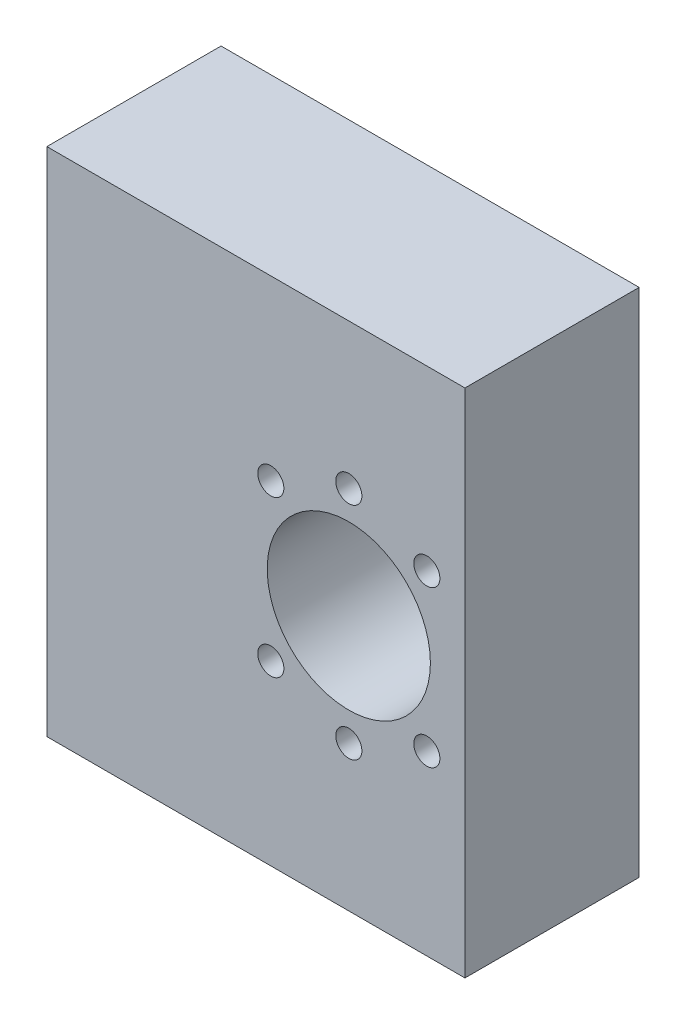
ISO-10303-21;
HEADER;
FILE_DESCRIPTION(('STEP AP214'),'2;1');
FILE_NAME('part.step','',(''),(''),'','','');
FILE_SCHEMA(('AUTOMOTIVE_DESIGN { 1 0 10303 214 1 1 1 1 }'));
ENDSEC;
DATA;
#1=APPLICATION_CONTEXT('core data for automotive mechanical design processes');
#2=APPLICATION_PROTOCOL_DEFINITION('international standard','automotive_design',2000,#1);
#3=PRODUCT_CONTEXT('',#1,'mechanical');
#4=PRODUCT('Part','Part','',(#3));
#5=PRODUCT_RELATED_PRODUCT_CATEGORY('part','',(#4));
#6=PRODUCT_DEFINITION_FORMATION('','',#4);
#7=PRODUCT_DEFINITION_CONTEXT('part definition',#1,'design');
#8=PRODUCT_DEFINITION('design','',#6,#7);
#9=PRODUCT_DEFINITION_SHAPE('','',#8);
#10=(LENGTH_UNIT() NAMED_UNIT(*) SI_UNIT(.MILLI.,.METRE.));
#11=(NAMED_UNIT(*) PLANE_ANGLE_UNIT() SI_UNIT($,.RADIAN.));
#12=(NAMED_UNIT(*) SI_UNIT($,.STERADIAN.) SOLID_ANGLE_UNIT());
#13=UNCERTAINTY_MEASURE_WITH_UNIT(LENGTH_MEASURE(1.E-05),#10,'distance_accuracy_value','');
#14=(GEOMETRIC_REPRESENTATION_CONTEXT(3) GLOBAL_UNCERTAINTY_ASSIGNED_CONTEXT((#13)) GLOBAL_UNIT_ASSIGNED_CONTEXT((#10,
#11,#12)) REPRESENTATION_CONTEXT('',''));
#15=CARTESIAN_POINT('',(0.,0.,0.));
#16=DIRECTION('',(0.,0.,1.));
#17=DIRECTION('',(1.,0.,0.));
#18=AXIS2_PLACEMENT_3D('',#15,#16,#17);
#19=CARTESIAN_POINT('',(-52.,-88.5803268221012,40.));
#20=DIRECTION('',(1.,0.,0.));
#21=DIRECTION('',(0.,0.,-1.));
#22=AXIS2_PLACEMENT_3D('',#19,#20,#21);
#23=PLANE('',#22);
#24=CARTESIAN_POINT('',(-52.,39.,32.5));
#25=DIRECTION('',(-1.,0.,0.));
#26=DIRECTION('',(0.,0.,1.));
#27=AXIS2_PLACEMENT_3D('',#24,#25,#26);
#28=CIRCLE('',#27,2.25);
#29=CARTESIAN_POINT('',(-52.,39.,34.75));
#30=VERTEX_POINT('',#29);
#31=EDGE_CURVE('E294',#30,#30,#28,.T.);
#32=ORIENTED_EDGE('',*,*,#31,.F.);
#33=EDGE_LOOP('',(#32));
#34=FACE_BOUND('',#33,.T.);
#35=CARTESIAN_POINT('',(-52.,19.,32.5));
#36=DIRECTION('',(-1.,0.,0.));
#37=DIRECTION('',(0.,0.,1.));
#38=AXIS2_PLACEMENT_3D('',#35,#36,#37);
#39=CIRCLE('',#38,2.25);
#40=CARTESIAN_POINT('',(-52.,19.,34.75));
#41=VERTEX_POINT('',#40);
#42=EDGE_CURVE('E293',#41,#41,#39,.T.);
#43=ORIENTED_EDGE('',*,*,#42,.F.);
#44=EDGE_LOOP('',(#43));
#45=FACE_BOUND('',#44,.T.);
#46=CARTESIAN_POINT('',(-52.,0.,32.5));
#47=DIRECTION('',(-1.,0.,0.));
#48=DIRECTION('',(0.,0.,1.));
#49=AXIS2_PLACEMENT_3D('',#46,#47,#48);
#50=CIRCLE('',#49,2.25);
#51=CARTESIAN_POINT('',(-52.,0.,34.75));
#52=VERTEX_POINT('',#51);
#53=EDGE_CURVE('E304',#52,#52,#50,.T.);
#54=ORIENTED_EDGE('',*,*,#53,.F.);
#55=EDGE_LOOP('',(#54));
#56=FACE_BOUND('',#55,.T.);
#57=CARTESIAN_POINT('',(-52.,-19.,32.5));
#58=DIRECTION('',(-1.,0.,0.));
#59=DIRECTION('',(0.,0.,1.));
#60=AXIS2_PLACEMENT_3D('',#57,#58,#59);
#61=CIRCLE('',#60,2.25);
#62=CARTESIAN_POINT('',(-52.,-19.,34.75));
#63=VERTEX_POINT('',#62);
#64=EDGE_CURVE('E310',#63,#63,#61,.T.);
#65=ORIENTED_EDGE('',*,*,#64,.F.);
#66=EDGE_LOOP('',(#65));
#67=FACE_BOUND('',#66,.T.);
#68=CARTESIAN_POINT('',(-52.,-39.,32.5));
#69=DIRECTION('',(-1.,0.,0.));
#70=DIRECTION('',(0.,0.,1.));
#71=AXIS2_PLACEMENT_3D('',#68,#69,#70);
#72=CIRCLE('',#71,2.25);
#73=CARTESIAN_POINT('',(-52.,-39.,34.75));
#74=VERTEX_POINT('',#73);
#75=EDGE_CURVE('E316',#74,#74,#72,.T.);
#76=ORIENTED_EDGE('',*,*,#75,.F.);
#77=EDGE_LOOP('',(#76));
#78=FACE_BOUND('',#77,.T.);
#79=CARTESIAN_POINT('',(-52.,0.,17.5));
#80=DIRECTION('',(-1.,0.,0.));
#81=DIRECTION('',(0.,0.,1.));
#82=AXIS2_PLACEMENT_3D('',#79,#80,#81);
#83=CIRCLE('',#82,2.25);
#84=CARTESIAN_POINT('',(-52.,0.,19.75));
#85=VERTEX_POINT('',#84);
#86=EDGE_CURVE('E322',#85,#85,#83,.T.);
#87=ORIENTED_EDGE('',*,*,#86,.F.);
#88=EDGE_LOOP('',(#87));
#89=FACE_BOUND('',#88,.T.);
#90=CARTESIAN_POINT('',(-52.,-19.,17.5));
#91=DIRECTION('',(-1.,0.,0.));
#92=DIRECTION('',(0.,0.,1.));
#93=AXIS2_PLACEMENT_3D('',#90,#91,#92);
#94=CIRCLE('',#93,2.25);
#95=CARTESIAN_POINT('',(-52.,-19.,19.75));
#96=VERTEX_POINT('',#95);
#97=EDGE_CURVE('E328',#96,#96,#94,.T.);
#98=ORIENTED_EDGE('',*,*,#97,.F.);
#99=EDGE_LOOP('',(#98));
#100=FACE_BOUND('',#99,.T.);
#101=CARTESIAN_POINT('',(-52.,-39.,17.5));
#102=DIRECTION('',(-1.,0.,0.));
#103=DIRECTION('',(0.,0.,1.));
#104=AXIS2_PLACEMENT_3D('',#101,#102,#103);
#105=CIRCLE('',#104,2.25);
#106=CARTESIAN_POINT('',(-52.,-39.,19.75));
#107=VERTEX_POINT('',#106);
#108=EDGE_CURVE('E334',#107,#107,#105,.T.);
#109=ORIENTED_EDGE('',*,*,#108,.F.);
#110=EDGE_LOOP('',(#109));
#111=FACE_BOUND('',#110,.T.);
#112=CARTESIAN_POINT('',(-52.,39.,17.5));
#113=DIRECTION('',(-1.,0.,0.));
#114=DIRECTION('',(0.,0.,1.));
#115=AXIS2_PLACEMENT_3D('',#112,#113,#114);
#116=CIRCLE('',#115,2.25);
#117=CARTESIAN_POINT('',(-52.,39.,19.75));
#118=VERTEX_POINT('',#117);
#119=EDGE_CURVE('E340',#118,#118,#116,.T.);
#120=ORIENTED_EDGE('',*,*,#119,.F.);
#121=EDGE_LOOP('',(#120));
#122=FACE_BOUND('',#121,.T.);
#123=CARTESIAN_POINT('',(-52.,19.,17.5));
#124=DIRECTION('',(-1.,0.,0.));
#125=DIRECTION('',(0.,0.,1.));
#126=AXIS2_PLACEMENT_3D('',#123,#124,#125);
#127=CIRCLE('',#126,2.25);
#128=CARTESIAN_POINT('',(-52.,19.,19.75));
#129=VERTEX_POINT('',#128);
#130=EDGE_CURVE('E346',#129,#129,#127,.T.);
#131=ORIENTED_EDGE('',*,*,#130,.F.);
#132=EDGE_LOOP('',(#131));
#133=FACE_BOUND('',#132,.T.);
#134=DIRECTION('',(0.,-1.,0.));
#135=VECTOR('',#134,1.);
#136=CARTESIAN_POINT('',(-52.,-88.5803268221012,10.));
#137=LINE('',#136,#135);
#138=CARTESIAN_POINT('',(-52.,44.,10.));
#139=VERTEX_POINT('',#138);
#140=CARTESIAN_POINT('',(-52.,-44.,10.));
#141=VERTEX_POINT('',#140);
#142=EDGE_CURVE('E77',#139,#141,#137,.T.);
#143=ORIENTED_EDGE('',*,*,#142,.T.);
#144=DIRECTION('',(0.,0.,-1.));
#145=VECTOR('',#144,1.);
#146=CARTESIAN_POINT('',(-52.,-44.,40.));
#147=LINE('',#146,#145);
#148=CARTESIAN_POINT('',(-52.,-44.,40.));
#149=VERTEX_POINT('',#148);
#150=EDGE_CURVE('E11',#149,#141,#147,.T.);
#151=ORIENTED_EDGE('',*,*,#150,.F.);
#152=DIRECTION('',(0.,-1.,0.));
#153=VECTOR('',#152,1.);
#154=CARTESIAN_POINT('',(-52.,-88.5803268221012,40.));
#155=LINE('',#154,#153);
#156=CARTESIAN_POINT('',(-52.,44.,40.));
#157=VERTEX_POINT('',#156);
#158=EDGE_CURVE('E118',#157,#149,#155,.T.);
#159=ORIENTED_EDGE('',*,*,#158,.F.);
#160=DIRECTION('',(0.,0.,-1.));
#161=VECTOR('',#160,1.);
#162=CARTESIAN_POINT('',(-52.,44.,40.));
#163=LINE('',#162,#161);
#164=EDGE_CURVE('E44',#157,#139,#163,.T.);
#165=ORIENTED_EDGE('',*,*,#164,.T.);
#166=EDGE_LOOP('',(#143,#151,#159,#165));
#167=FACE_BOUND('',#166,.T.);
#168=ADVANCED_FACE('F29',(#34,#45,#56,#67,#78,#89,#100,#111,#122,#133,#167),#23,.F.);
#169=CARTESIAN_POINT('',(-16.,-44.,40.));
#170=DIRECTION('',(0.,1.,0.));
#171=DIRECTION('',(0.,0.,1.));
#172=AXIS2_PLACEMENT_3D('',#169,#170,#171);
#173=PLANE('',#172);
#174=DIRECTION('',(1.,0.,0.));
#175=VECTOR('',#174,1.);
#176=CARTESIAN_POINT('',(-16.,-44.,10.));
#177=LINE('',#176,#175);
#178=CARTESIAN_POINT('',(20.,-44.,10.));
#179=VERTEX_POINT('',#178);
#180=EDGE_CURVE('E73',#141,#179,#177,.T.);
#181=ORIENTED_EDGE('',*,*,#180,.T.);
#182=DIRECTION('',(0.,0.,-1.));
#183=VECTOR('',#182,1.);
#184=CARTESIAN_POINT('',(20.,-44.,40.));
#185=LINE('',#184,#183);
#186=CARTESIAN_POINT('',(20.,-44.,40.));
#187=VERTEX_POINT('',#186);
#188=EDGE_CURVE('E37',#187,#179,#185,.T.);
#189=ORIENTED_EDGE('',*,*,#188,.F.);
#190=DIRECTION('',(1.,0.,0.));
#191=VECTOR('',#190,1.);
#192=CARTESIAN_POINT('',(-16.,-44.,40.));
#193=LINE('',#192,#191);
#194=EDGE_CURVE('E84',#149,#187,#193,.T.);
#195=ORIENTED_EDGE('',*,*,#194,.F.);
#196=ORIENTED_EDGE('',*,*,#150,.T.);
#197=EDGE_LOOP('',(#181,#189,#195,#196));
#198=FACE_BOUND('',#197,.T.);
#199=ADVANCED_FACE('F83',(#198),#173,.F.);
#200=CARTESIAN_POINT('',(20.,-88.5803268221012,40.));
#201=DIRECTION('',(1.,0.,0.));
#202=DIRECTION('',(0.,1.,0.));
#203=AXIS2_PLACEMENT_3D('',#200,#201,#202);
#204=PLANE('',#203);
#205=DIRECTION('',(0.,-1.,0.));
#206=VECTOR('',#205,1.);
#207=CARTESIAN_POINT('',(20.,-88.5803268221012,10.));
#208=LINE('',#207,#206);
#209=CARTESIAN_POINT('',(20.,44.,10.));
#210=VERTEX_POINT('',#209);
#211=EDGE_CURVE('E78',#210,#179,#208,.T.);
#212=ORIENTED_EDGE('',*,*,#211,.F.);
#213=DIRECTION('',(0.,0.,-1.));
#214=VECTOR('',#213,1.);
#215=CARTESIAN_POINT('',(20.,44.,40.));
#216=LINE('',#215,#214);
#217=CARTESIAN_POINT('',(20.,44.,40.));
#218=VERTEX_POINT('',#217);
#219=EDGE_CURVE('E52',#218,#210,#216,.T.);
#220=ORIENTED_EDGE('',*,*,#219,.F.);
#221=DIRECTION('',(0.,-1.,0.));
#222=VECTOR('',#221,1.);
#223=CARTESIAN_POINT('',(20.,-88.5803268221012,40.));
#224=LINE('',#223,#222);
#225=EDGE_CURVE('E121',#218,#187,#224,.T.);
#226=ORIENTED_EDGE('',*,*,#225,.T.);
#227=ORIENTED_EDGE('',*,*,#188,.T.);
#228=EDGE_LOOP('',(#212,#220,#226,#227));
#229=FACE_BOUND('',#228,.T.);
#230=ADVANCED_FACE('F126',(#229),#204,.T.);
#231=CARTESIAN_POINT('',(0.,0.,40.));
#232=DIRECTION('',(0.,0.,-1.));
#233=DIRECTION('',(-1.,0.,0.));
#234=AXIS2_PLACEMENT_3D('',#231,#232,#233);
#235=CYLINDRICAL_SURFACE('',#234,14.05);
#236=CARTESIAN_POINT('',(0.,0.,40.));
#237=DIRECTION('',(0.,0.,1.));
#238=DIRECTION('',(1.,0.,0.));
#239=AXIS2_PLACEMENT_3D('',#236,#237,#238);
#240=CIRCLE('',#239,14.05);
#241=CARTESIAN_POINT('',(14.05,0.,40.));
#242=VERTEX_POINT('',#241);
#243=EDGE_CURVE('E115',#242,#242,#240,.T.);
#244=ORIENTED_EDGE('',*,*,#243,.T.);
#245=EDGE_LOOP('',(#244));
#246=FACE_BOUND('',#245,.T.);
#247=CARTESIAN_POINT('',(0.,0.,10.));
#248=DIRECTION('',(0.,0.,1.));
#249=DIRECTION('',(1.,0.,0.));
#250=AXIS2_PLACEMENT_3D('',#247,#248,#249);
#251=CIRCLE('',#250,14.05);
#252=CARTESIAN_POINT('',(14.05,0.,10.));
#253=VERTEX_POINT('',#252);
#254=EDGE_CURVE('E87',#253,#253,#251,.T.);
#255=ORIENTED_EDGE('',*,*,#254,.F.);
#256=EDGE_LOOP('',(#255));
#257=FACE_BOUND('',#256,.T.);
#258=ADVANCED_FACE('F154',(#246,#257),#235,.F.);
#259=CARTESIAN_POINT('',(-13.4350288425445,13.4350288425444,40.));
#260=DIRECTION('',(0.,0.,-1.));
#261=DIRECTION('',(-1.,0.,0.));
#262=AXIS2_PLACEMENT_3D('',#259,#260,#261);
#263=CYLINDRICAL_SURFACE('',#262,2.25);
#264=CARTESIAN_POINT('',(-13.4350288425445,13.4350288425444,40.));
#265=DIRECTION('',(0.,0.,1.));
#266=DIRECTION('',(1.,0.,0.));
#267=AXIS2_PLACEMENT_3D('',#264,#265,#266);
#268=CIRCLE('',#267,2.25);
#269=CARTESIAN_POINT('',(-11.1850288425445,13.4350288425444,40.));
#270=VERTEX_POINT('',#269);
#271=EDGE_CURVE('E112',#270,#270,#268,.T.);
#272=ORIENTED_EDGE('',*,*,#271,.T.);
#273=EDGE_LOOP('',(#272));
#274=FACE_BOUND('',#273,.T.);
#275=CARTESIAN_POINT('',(-13.4350288425445,13.4350288425444,10.));
#276=DIRECTION('',(0.,0.,1.));
#277=DIRECTION('',(1.,0.,0.));
#278=AXIS2_PLACEMENT_3D('',#275,#276,#277);
#279=CIRCLE('',#278,2.25);
#280=CARTESIAN_POINT('',(-11.1850288425445,13.4350288425444,10.));
#281=VERTEX_POINT('',#280);
#282=EDGE_CURVE('E90',#281,#281,#279,.T.);
#283=ORIENTED_EDGE('',*,*,#282,.F.);
#284=EDGE_LOOP('',(#283));
#285=FACE_BOUND('',#284,.T.);
#286=ADVANCED_FACE('F157',(#274,#285),#263,.F.);
#287=CARTESIAN_POINT('',(0.,19.,40.));
#288=DIRECTION('',(0.,0.,-1.));
#289=DIRECTION('',(-1.,0.,0.));
#290=AXIS2_PLACEMENT_3D('',#287,#288,#289);
#291=CYLINDRICAL_SURFACE('',#290,2.25);
#292=CARTESIAN_POINT('',(0.,19.,40.));
#293=DIRECTION('',(0.,0.,1.));
#294=DIRECTION('',(1.,0.,0.));
#295=AXIS2_PLACEMENT_3D('',#292,#293,#294);
#296=CIRCLE('',#295,2.25);
#297=CARTESIAN_POINT('',(2.25,19.,40.));
#298=VERTEX_POINT('',#297);
#299=EDGE_CURVE('E109',#298,#298,#296,.T.);
#300=ORIENTED_EDGE('',*,*,#299,.T.);
#301=EDGE_LOOP('',(#300));
#302=FACE_BOUND('',#301,.T.);
#303=CARTESIAN_POINT('',(0.,19.,10.));
#304=DIRECTION('',(0.,0.,1.));
#305=DIRECTION('',(1.,0.,0.));
#306=AXIS2_PLACEMENT_3D('',#303,#304,#305);
#307=CIRCLE('',#306,2.25);
#308=CARTESIAN_POINT('',(2.25,19.,10.));
#309=VERTEX_POINT('',#308);
#310=EDGE_CURVE('E196',#309,#309,#307,.T.);
#311=ORIENTED_EDGE('',*,*,#310,.F.);
#312=EDGE_LOOP('',(#311));
#313=FACE_BOUND('',#312,.T.);
#314=ADVANCED_FACE('F161',(#302,#313),#291,.F.);
#315=CARTESIAN_POINT('',(13.4350288425444,13.4350288425444,40.));
#316=DIRECTION('',(0.,0.,-1.));
#317=DIRECTION('',(-1.,0.,0.));
#318=AXIS2_PLACEMENT_3D('',#315,#316,#317);
#319=CYLINDRICAL_SURFACE('',#318,2.25);
#320=CARTESIAN_POINT('',(13.4350288425444,13.4350288425444,40.));
#321=DIRECTION('',(0.,0.,1.));
#322=DIRECTION('',(1.,0.,0.));
#323=AXIS2_PLACEMENT_3D('',#320,#321,#322);
#324=CIRCLE('',#323,2.25);
#325=CARTESIAN_POINT('',(15.6850288425444,13.4350288425444,40.));
#326=VERTEX_POINT('',#325);
#327=EDGE_CURVE('E106',#326,#326,#324,.T.);
#328=ORIENTED_EDGE('',*,*,#327,.T.);
#329=EDGE_LOOP('',(#328));
#330=FACE_BOUND('',#329,.T.);
#331=CARTESIAN_POINT('',(13.4350288425444,13.4350288425444,10.));
#332=DIRECTION('',(0.,0.,1.));
#333=DIRECTION('',(1.,0.,0.));
#334=AXIS2_PLACEMENT_3D('',#331,#332,#333);
#335=CIRCLE('',#334,2.25);
#336=CARTESIAN_POINT('',(15.6850288425444,13.4350288425444,10.));
#337=VERTEX_POINT('',#336);
#338=EDGE_CURVE('E187',#337,#337,#335,.T.);
#339=ORIENTED_EDGE('',*,*,#338,.F.);
#340=EDGE_LOOP('',(#339));
#341=FACE_BOUND('',#340,.T.);
#342=ADVANCED_FACE('F165',(#330,#341),#319,.F.);
#343=CARTESIAN_POINT('',(13.4350288425444,-13.4350288425444,40.));
#344=DIRECTION('',(0.,0.,-1.));
#345=DIRECTION('',(-1.,0.,0.));
#346=AXIS2_PLACEMENT_3D('',#343,#344,#345);
#347=CYLINDRICAL_SURFACE('',#346,2.25);
#348=CARTESIAN_POINT('',(13.4350288425444,-13.4350288425444,40.));
#349=DIRECTION('',(0.,0.,1.));
#350=DIRECTION('',(1.,0.,0.));
#351=AXIS2_PLACEMENT_3D('',#348,#349,#350);
#352=CIRCLE('',#351,2.25);
#353=CARTESIAN_POINT('',(15.6850288425444,-13.4350288425444,40.));
#354=VERTEX_POINT('',#353);
#355=EDGE_CURVE('E103',#354,#354,#352,.T.);
#356=ORIENTED_EDGE('',*,*,#355,.T.);
#357=EDGE_LOOP('',(#356));
#358=FACE_BOUND('',#357,.T.);
#359=CARTESIAN_POINT('',(13.4350288425444,-13.4350288425444,10.));
#360=DIRECTION('',(0.,0.,1.));
#361=DIRECTION('',(1.,0.,0.));
#362=AXIS2_PLACEMENT_3D('',#359,#360,#361);
#363=CIRCLE('',#362,2.25);
#364=CARTESIAN_POINT('',(15.6850288425444,-13.4350288425444,10.));
#365=VERTEX_POINT('',#364);
#366=EDGE_CURVE('E183',#365,#365,#363,.T.);
#367=ORIENTED_EDGE('',*,*,#366,.F.);
#368=EDGE_LOOP('',(#367));
#369=FACE_BOUND('',#368,.T.);
#370=ADVANCED_FACE('F169',(#358,#369),#347,.F.);
#371=CARTESIAN_POINT('',(0.,-19.,40.));
#372=DIRECTION('',(0.,0.,-1.));
#373=DIRECTION('',(-1.,0.,0.));
#374=AXIS2_PLACEMENT_3D('',#371,#372,#373);
#375=CYLINDRICAL_SURFACE('',#374,2.25);
#376=CARTESIAN_POINT('',(0.,-19.,40.));
#377=DIRECTION('',(0.,0.,1.));
#378=DIRECTION('',(1.,0.,0.));
#379=AXIS2_PLACEMENT_3D('',#376,#377,#378);
#380=CIRCLE('',#379,2.25);
#381=CARTESIAN_POINT('',(2.25,-19.,40.));
#382=VERTEX_POINT('',#381);
#383=EDGE_CURVE('E100',#382,#382,#380,.T.);
#384=ORIENTED_EDGE('',*,*,#383,.T.);
#385=EDGE_LOOP('',(#384));
#386=FACE_BOUND('',#385,.T.);
#387=CARTESIAN_POINT('',(0.,-19.,10.));
#388=DIRECTION('',(0.,0.,1.));
#389=DIRECTION('',(1.,0.,0.));
#390=AXIS2_PLACEMENT_3D('',#387,#388,#389);
#391=CIRCLE('',#390,2.25);
#392=CARTESIAN_POINT('',(2.25,-19.,10.));
#393=VERTEX_POINT('',#392);
#394=EDGE_CURVE('E181',#393,#393,#391,.T.);
#395=ORIENTED_EDGE('',*,*,#394,.F.);
#396=EDGE_LOOP('',(#395));
#397=FACE_BOUND('',#396,.T.);
#398=ADVANCED_FACE('F139',(#386,#397),#375,.F.);
#399=CARTESIAN_POINT('',(-13.4350288425444,-13.4350288425444,40.));
#400=DIRECTION('',(0.,0.,-1.));
#401=DIRECTION('',(-1.,0.,0.));
#402=AXIS2_PLACEMENT_3D('',#399,#400,#401);
#403=CYLINDRICAL_SURFACE('',#402,2.25);
#404=CARTESIAN_POINT('',(-13.4350288425444,-13.4350288425444,40.));
#405=DIRECTION('',(0.,0.,1.));
#406=DIRECTION('',(1.,0.,0.));
#407=AXIS2_PLACEMENT_3D('',#404,#405,#406);
#408=CIRCLE('',#407,2.25);
#409=CARTESIAN_POINT('',(-11.1850288425444,-13.4350288425444,40.));
#410=VERTEX_POINT('',#409);
#411=EDGE_CURVE('E97',#410,#410,#408,.T.);
#412=ORIENTED_EDGE('',*,*,#411,.T.);
#413=EDGE_LOOP('',(#412));
#414=FACE_BOUND('',#413,.T.);
#415=CARTESIAN_POINT('',(-13.4350288425444,-13.4350288425444,10.));
#416=DIRECTION('',(0.,0.,1.));
#417=DIRECTION('',(1.,0.,0.));
#418=AXIS2_PLACEMENT_3D('',#415,#416,#417);
#419=CIRCLE('',#418,2.25);
#420=CARTESIAN_POINT('',(-11.1850288425444,-13.4350288425444,10.));
#421=VERTEX_POINT('',#420);
#422=EDGE_CURVE('E184',#421,#421,#419,.T.);
#423=ORIENTED_EDGE('',*,*,#422,.F.);
#424=EDGE_LOOP('',(#423));
#425=FACE_BOUND('',#424,.T.);
#426=ADVANCED_FACE('F31',(#414,#425),#403,.F.);
#427=CARTESIAN_POINT('',(-16.,44.,40.));
#428=DIRECTION('',(0.,1.,0.));
#429=DIRECTION('',(0.,0.,1.));
#430=AXIS2_PLACEMENT_3D('',#427,#428,#429);
#431=PLANE('',#430);
#432=DIRECTION('',(1.,0.,0.));
#433=VECTOR('',#432,1.);
#434=CARTESIAN_POINT('',(-16.,44.,10.));
#435=LINE('',#434,#433);
#436=EDGE_CURVE('E95',#139,#210,#435,.T.);
#437=ORIENTED_EDGE('',*,*,#436,.F.);
#438=ORIENTED_EDGE('',*,*,#164,.F.);
#439=DIRECTION('',(1.,0.,0.));
#440=VECTOR('',#439,1.);
#441=CARTESIAN_POINT('',(-16.,44.,40.));
#442=LINE('',#441,#440);
#443=EDGE_CURVE('E123',#157,#218,#442,.T.);
#444=ORIENTED_EDGE('',*,*,#443,.T.);
#445=ORIENTED_EDGE('',*,*,#219,.T.);
#446=EDGE_LOOP('',(#437,#438,#444,#445));
#447=FACE_BOUND('',#446,.T.);
#448=ADVANCED_FACE('F130',(#447),#431,.T.);
#449=CARTESIAN_POINT('',(-16.,-88.5803268221012,40.));
#450=DIRECTION('',(0.,0.,1.));
#451=DIRECTION('',(1.,0.,0.));
#452=AXIS2_PLACEMENT_3D('',#449,#450,#451);
#453=PLANE('',#452);
#454=ORIENTED_EDGE('',*,*,#411,.F.);
#455=EDGE_LOOP('',(#454));
#456=FACE_BOUND('',#455,.T.);
#457=ORIENTED_EDGE('',*,*,#383,.F.);
#458=EDGE_LOOP('',(#457));
#459=FACE_BOUND('',#458,.T.);
#460=ORIENTED_EDGE('',*,*,#355,.F.);
#461=EDGE_LOOP('',(#460));
#462=FACE_BOUND('',#461,.T.);
#463=ORIENTED_EDGE('',*,*,#327,.F.);
#464=EDGE_LOOP('',(#463));
#465=FACE_BOUND('',#464,.T.);
#466=ORIENTED_EDGE('',*,*,#299,.F.);
#467=EDGE_LOOP('',(#466));
#468=FACE_BOUND('',#467,.T.);
#469=ORIENTED_EDGE('',*,*,#271,.F.);
#470=EDGE_LOOP('',(#469));
#471=FACE_BOUND('',#470,.T.);
#472=ORIENTED_EDGE('',*,*,#243,.F.);
#473=EDGE_LOOP('',(#472));
#474=FACE_BOUND('',#473,.T.);
#475=ORIENTED_EDGE('',*,*,#158,.T.);
#476=ORIENTED_EDGE('',*,*,#194,.T.);
#477=ORIENTED_EDGE('',*,*,#225,.F.);
#478=ORIENTED_EDGE('',*,*,#443,.F.);
#479=EDGE_LOOP('',(#475,#476,#477,#478));
#480=FACE_BOUND('',#479,.T.);
#481=ADVANCED_FACE('F129',(#456,#459,#462,#465,#468,#471,#474,#480),#453,.T.);
#482=CARTESIAN_POINT('',(-16.,-88.5803268221012,10.));
#483=DIRECTION('',(0.,0.,1.));
#484=DIRECTION('',(1.,0.,0.));
#485=AXIS2_PLACEMENT_3D('',#482,#483,#484);
#486=PLANE('',#485);
#487=ORIENTED_EDGE('',*,*,#422,.T.);
#488=EDGE_LOOP('',(#487));
#489=FACE_BOUND('',#488,.T.);
#490=ORIENTED_EDGE('',*,*,#394,.T.);
#491=EDGE_LOOP('',(#490));
#492=FACE_BOUND('',#491,.T.);
#493=ORIENTED_EDGE('',*,*,#366,.T.);
#494=EDGE_LOOP('',(#493));
#495=FACE_BOUND('',#494,.T.);
#496=ORIENTED_EDGE('',*,*,#338,.T.);
#497=EDGE_LOOP('',(#496));
#498=FACE_BOUND('',#497,.T.);
#499=ORIENTED_EDGE('',*,*,#310,.T.);
#500=EDGE_LOOP('',(#499));
#501=FACE_BOUND('',#500,.T.);
#502=ORIENTED_EDGE('',*,*,#282,.T.);
#503=EDGE_LOOP('',(#502));
#504=FACE_BOUND('',#503,.T.);
#505=ORIENTED_EDGE('',*,*,#254,.T.);
#506=EDGE_LOOP('',(#505));
#507=FACE_BOUND('',#506,.T.);
#508=ORIENTED_EDGE('',*,*,#142,.F.);
#509=ORIENTED_EDGE('',*,*,#436,.T.);
#510=ORIENTED_EDGE('',*,*,#211,.T.);
#511=ORIENTED_EDGE('',*,*,#180,.F.);
#512=EDGE_LOOP('',(#508,#509,#510,#511));
#513=FACE_BOUND('',#512,.T.);
#514=ADVANCED_FACE('F74',(#489,#492,#495,#498,#501,#504,#507,#513),#486,.F.);
#515=CARTESIAN_POINT('',(-22.,19.,17.5));
#516=DIRECTION('',(-1.,0.,0.));
#517=DIRECTION('',(0.,0.,1.));
#518=AXIS2_PLACEMENT_3D('',#515,#516,#517);
#519=CYLINDRICAL_SURFACE('',#518,2.25);
#520=CARTESIAN_POINT('',(-22.,19.,17.5));
#521=DIRECTION('',(-1.,0.,0.));
#522=DIRECTION('',(0.,0.,1.));
#523=AXIS2_PLACEMENT_3D('',#520,#521,#522);
#524=CIRCLE('',#523,2.25);
#525=CARTESIAN_POINT('',(-22.,19.,19.75));
#526=VERTEX_POINT('',#525);
#527=EDGE_CURVE('E190',#526,#526,#524,.T.);
#528=ORIENTED_EDGE('',*,*,#527,.F.);
#529=EDGE_LOOP('',(#528));
#530=FACE_BOUND('',#529,.T.);
#531=ORIENTED_EDGE('',*,*,#130,.T.);
#532=EDGE_LOOP('',(#531));
#533=FACE_BOUND('',#532,.T.);
#534=ADVANCED_FACE('F203',(#530,#533),#519,.F.);
#535=CARTESIAN_POINT('',(-22.,19.,17.5));
#536=DIRECTION('',(-1.,0.,0.));
#537=DIRECTION('',(0.,0.,1.));
#538=AXIS2_PLACEMENT_3D('',#535,#536,#537);
#539=PLANE('',#538);
#540=ORIENTED_EDGE('',*,*,#527,.T.);
#541=EDGE_LOOP('',(#540));
#542=FACE_BOUND('',#541,.T.);
#543=ADVANCED_FACE('F210',(#542),#539,.T.);
#544=CARTESIAN_POINT('',(-22.,39.,17.5));
#545=DIRECTION('',(-1.,0.,0.));
#546=DIRECTION('',(0.,0.,1.));
#547=AXIS2_PLACEMENT_3D('',#544,#545,#546);
#548=CYLINDRICAL_SURFACE('',#547,2.25);
#549=CARTESIAN_POINT('',(-22.,39.,17.5));
#550=DIRECTION('',(-1.,0.,0.));
#551=DIRECTION('',(0.,0.,1.));
#552=AXIS2_PLACEMENT_3D('',#549,#550,#551);
#553=CIRCLE('',#552,2.25);
#554=CARTESIAN_POINT('',(-22.,39.,19.75));
#555=VERTEX_POINT('',#554);
#556=EDGE_CURVE('E343',#555,#555,#553,.T.);
#557=ORIENTED_EDGE('',*,*,#556,.F.);
#558=EDGE_LOOP('',(#557));
#559=FACE_BOUND('',#558,.T.);
#560=ORIENTED_EDGE('',*,*,#119,.T.);
#561=EDGE_LOOP('',(#560));
#562=FACE_BOUND('',#561,.T.);
#563=ADVANCED_FACE('F216',(#559,#562),#548,.F.);
#564=CARTESIAN_POINT('',(-22.,39.,17.5));
#565=DIRECTION('',(-1.,0.,0.));
#566=DIRECTION('',(0.,0.,1.));
#567=AXIS2_PLACEMENT_3D('',#564,#565,#566);
#568=PLANE('',#567);
#569=ORIENTED_EDGE('',*,*,#556,.T.);
#570=EDGE_LOOP('',(#569));
#571=FACE_BOUND('',#570,.T.);
#572=ADVANCED_FACE('F220',(#571),#568,.T.);
#573=CARTESIAN_POINT('',(-22.,-39.,17.5));
#574=DIRECTION('',(-1.,0.,0.));
#575=DIRECTION('',(0.,0.,1.));
#576=AXIS2_PLACEMENT_3D('',#573,#574,#575);
#577=CYLINDRICAL_SURFACE('',#576,2.25);
#578=CARTESIAN_POINT('',(-22.,-39.,17.5));
#579=DIRECTION('',(-1.,0.,0.));
#580=DIRECTION('',(0.,0.,1.));
#581=AXIS2_PLACEMENT_3D('',#578,#579,#580);
#582=CIRCLE('',#581,2.25);
#583=CARTESIAN_POINT('',(-22.,-39.,19.75));
#584=VERTEX_POINT('',#583);
#585=EDGE_CURVE('E337',#584,#584,#582,.T.);
#586=ORIENTED_EDGE('',*,*,#585,.F.);
#587=EDGE_LOOP('',(#586));
#588=FACE_BOUND('',#587,.T.);
#589=ORIENTED_EDGE('',*,*,#108,.T.);
#590=EDGE_LOOP('',(#589));
#591=FACE_BOUND('',#590,.T.);
#592=ADVANCED_FACE('F224',(#588,#591),#577,.F.);
#593=CARTESIAN_POINT('',(-22.,-39.,17.5));
#594=DIRECTION('',(-1.,0.,0.));
#595=DIRECTION('',(0.,0.,1.));
#596=AXIS2_PLACEMENT_3D('',#593,#594,#595);
#597=PLANE('',#596);
#598=ORIENTED_EDGE('',*,*,#585,.T.);
#599=EDGE_LOOP('',(#598));
#600=FACE_BOUND('',#599,.T.);
#601=ADVANCED_FACE('F228',(#600),#597,.T.);
#602=CARTESIAN_POINT('',(-22.,-19.,17.5));
#603=DIRECTION('',(-1.,0.,0.));
#604=DIRECTION('',(0.,0.,1.));
#605=AXIS2_PLACEMENT_3D('',#602,#603,#604);
#606=CYLINDRICAL_SURFACE('',#605,2.25);
#607=CARTESIAN_POINT('',(-22.,-19.,17.5));
#608=DIRECTION('',(-1.,0.,0.));
#609=DIRECTION('',(0.,0.,1.));
#610=AXIS2_PLACEMENT_3D('',#607,#608,#609);
#611=CIRCLE('',#610,2.25);
#612=CARTESIAN_POINT('',(-22.,-19.,19.75));
#613=VERTEX_POINT('',#612);
#614=EDGE_CURVE('E331',#613,#613,#611,.T.);
#615=ORIENTED_EDGE('',*,*,#614,.F.);
#616=EDGE_LOOP('',(#615));
#617=FACE_BOUND('',#616,.T.);
#618=ORIENTED_EDGE('',*,*,#97,.T.);
#619=EDGE_LOOP('',(#618));
#620=FACE_BOUND('',#619,.T.);
#621=ADVANCED_FACE('F232',(#617,#620),#606,.F.);
#622=CARTESIAN_POINT('',(-22.,-19.,17.5));
#623=DIRECTION('',(-1.,0.,0.));
#624=DIRECTION('',(0.,0.,1.));
#625=AXIS2_PLACEMENT_3D('',#622,#623,#624);
#626=PLANE('',#625);
#627=ORIENTED_EDGE('',*,*,#614,.T.);
#628=EDGE_LOOP('',(#627));
#629=FACE_BOUND('',#628,.T.);
#630=ADVANCED_FACE('F236',(#629),#626,.T.);
#631=CARTESIAN_POINT('',(-22.,0.,17.5));
#632=DIRECTION('',(-1.,0.,0.));
#633=DIRECTION('',(0.,0.,1.));
#634=AXIS2_PLACEMENT_3D('',#631,#632,#633);
#635=CYLINDRICAL_SURFACE('',#634,2.25);
#636=CARTESIAN_POINT('',(-22.,0.,17.5));
#637=DIRECTION('',(-1.,0.,0.));
#638=DIRECTION('',(0.,0.,1.));
#639=AXIS2_PLACEMENT_3D('',#636,#637,#638);
#640=CIRCLE('',#639,2.25);
#641=CARTESIAN_POINT('',(-22.,0.,19.75));
#642=VERTEX_POINT('',#641);
#643=EDGE_CURVE('E325',#642,#642,#640,.T.);
#644=ORIENTED_EDGE('',*,*,#643,.F.);
#645=EDGE_LOOP('',(#644));
#646=FACE_BOUND('',#645,.T.);
#647=ORIENTED_EDGE('',*,*,#86,.T.);
#648=EDGE_LOOP('',(#647));
#649=FACE_BOUND('',#648,.T.);
#650=ADVANCED_FACE('F240',(#646,#649),#635,.F.);
#651=CARTESIAN_POINT('',(-22.,0.,17.5));
#652=DIRECTION('',(-1.,0.,0.));
#653=DIRECTION('',(0.,0.,1.));
#654=AXIS2_PLACEMENT_3D('',#651,#652,#653);
#655=PLANE('',#654);
#656=ORIENTED_EDGE('',*,*,#643,.T.);
#657=EDGE_LOOP('',(#656));
#658=FACE_BOUND('',#657,.T.);
#659=ADVANCED_FACE('F244',(#658),#655,.T.);
#660=CARTESIAN_POINT('',(-22.,-39.,32.5));
#661=DIRECTION('',(-1.,0.,0.));
#662=DIRECTION('',(0.,0.,1.));
#663=AXIS2_PLACEMENT_3D('',#660,#661,#662);
#664=CYLINDRICAL_SURFACE('',#663,2.25);
#665=CARTESIAN_POINT('',(-22.,-39.,32.5));
#666=DIRECTION('',(-1.,0.,0.));
#667=DIRECTION('',(0.,0.,1.));
#668=AXIS2_PLACEMENT_3D('',#665,#666,#667);
#669=CIRCLE('',#668,2.25);
#670=CARTESIAN_POINT('',(-22.,-39.,34.75));
#671=VERTEX_POINT('',#670);
#672=EDGE_CURVE('E319',#671,#671,#669,.T.);
#673=ORIENTED_EDGE('',*,*,#672,.F.);
#674=EDGE_LOOP('',(#673));
#675=FACE_BOUND('',#674,.T.);
#676=ORIENTED_EDGE('',*,*,#75,.T.);
#677=EDGE_LOOP('',(#676));
#678=FACE_BOUND('',#677,.T.);
#679=ADVANCED_FACE('F248',(#675,#678),#664,.F.);
#680=CARTESIAN_POINT('',(-22.,-39.,32.5));
#681=DIRECTION('',(-1.,0.,0.));
#682=DIRECTION('',(0.,0.,1.));
#683=AXIS2_PLACEMENT_3D('',#680,#681,#682);
#684=PLANE('',#683);
#685=ORIENTED_EDGE('',*,*,#672,.T.);
#686=EDGE_LOOP('',(#685));
#687=FACE_BOUND('',#686,.T.);
#688=ADVANCED_FACE('F252',(#687),#684,.T.);
#689=CARTESIAN_POINT('',(-22.,-19.,32.5));
#690=DIRECTION('',(-1.,0.,0.));
#691=DIRECTION('',(0.,0.,1.));
#692=AXIS2_PLACEMENT_3D('',#689,#690,#691);
#693=CYLINDRICAL_SURFACE('',#692,2.25);
#694=CARTESIAN_POINT('',(-22.,-19.,32.5));
#695=DIRECTION('',(-1.,0.,0.));
#696=DIRECTION('',(0.,0.,1.));
#697=AXIS2_PLACEMENT_3D('',#694,#695,#696);
#698=CIRCLE('',#697,2.25);
#699=CARTESIAN_POINT('',(-22.,-19.,34.75));
#700=VERTEX_POINT('',#699);
#701=EDGE_CURVE('E313',#700,#700,#698,.T.);
#702=ORIENTED_EDGE('',*,*,#701,.F.);
#703=EDGE_LOOP('',(#702));
#704=FACE_BOUND('',#703,.T.);
#705=ORIENTED_EDGE('',*,*,#64,.T.);
#706=EDGE_LOOP('',(#705));
#707=FACE_BOUND('',#706,.T.);
#708=ADVANCED_FACE('F256',(#704,#707),#693,.F.);
#709=CARTESIAN_POINT('',(-22.,-19.,32.5));
#710=DIRECTION('',(-1.,0.,0.));
#711=DIRECTION('',(0.,0.,1.));
#712=AXIS2_PLACEMENT_3D('',#709,#710,#711);
#713=PLANE('',#712);
#714=ORIENTED_EDGE('',*,*,#701,.T.);
#715=EDGE_LOOP('',(#714));
#716=FACE_BOUND('',#715,.T.);
#717=ADVANCED_FACE('F260',(#716),#713,.T.);
#718=CARTESIAN_POINT('',(-22.,0.,32.5));
#719=DIRECTION('',(-1.,0.,0.));
#720=DIRECTION('',(0.,0.,1.));
#721=AXIS2_PLACEMENT_3D('',#718,#719,#720);
#722=CYLINDRICAL_SURFACE('',#721,2.25);
#723=CARTESIAN_POINT('',(-22.,0.,32.5));
#724=DIRECTION('',(-1.,0.,0.));
#725=DIRECTION('',(0.,0.,1.));
#726=AXIS2_PLACEMENT_3D('',#723,#724,#725);
#727=CIRCLE('',#726,2.25);
#728=CARTESIAN_POINT('',(-22.,0.,34.75));
#729=VERTEX_POINT('',#728);
#730=EDGE_CURVE('E307',#729,#729,#727,.T.);
#731=ORIENTED_EDGE('',*,*,#730,.F.);
#732=EDGE_LOOP('',(#731));
#733=FACE_BOUND('',#732,.T.);
#734=ORIENTED_EDGE('',*,*,#53,.T.);
#735=EDGE_LOOP('',(#734));
#736=FACE_BOUND('',#735,.T.);
#737=ADVANCED_FACE('F264',(#733,#736),#722,.F.);
#738=CARTESIAN_POINT('',(-22.,0.,32.5));
#739=DIRECTION('',(-1.,0.,0.));
#740=DIRECTION('',(0.,0.,1.));
#741=AXIS2_PLACEMENT_3D('',#738,#739,#740);
#742=PLANE('',#741);
#743=ORIENTED_EDGE('',*,*,#730,.T.);
#744=EDGE_LOOP('',(#743));
#745=FACE_BOUND('',#744,.T.);
#746=ADVANCED_FACE('F268',(#745),#742,.T.);
#747=CARTESIAN_POINT('',(-22.,19.,32.5));
#748=DIRECTION('',(-1.,0.,0.));
#749=DIRECTION('',(0.,0.,1.));
#750=AXIS2_PLACEMENT_3D('',#747,#748,#749);
#751=CYLINDRICAL_SURFACE('',#750,2.25);
#752=CARTESIAN_POINT('',(-22.,19.,32.5));
#753=DIRECTION('',(-1.,0.,0.));
#754=DIRECTION('',(0.,0.,1.));
#755=AXIS2_PLACEMENT_3D('',#752,#753,#754);
#756=CIRCLE('',#755,2.25);
#757=CARTESIAN_POINT('',(-22.,19.,34.75));
#758=VERTEX_POINT('',#757);
#759=EDGE_CURVE('E297',#758,#758,#756,.T.);
#760=ORIENTED_EDGE('',*,*,#759,.F.);
#761=EDGE_LOOP('',(#760));
#762=FACE_BOUND('',#761,.T.);
#763=ORIENTED_EDGE('',*,*,#42,.T.);
#764=EDGE_LOOP('',(#763));
#765=FACE_BOUND('',#764,.T.);
#766=ADVANCED_FACE('F272',(#762,#765),#751,.F.);
#767=CARTESIAN_POINT('',(-22.,19.,32.5));
#768=DIRECTION('',(-1.,0.,0.));
#769=DIRECTION('',(0.,0.,1.));
#770=AXIS2_PLACEMENT_3D('',#767,#768,#769);
#771=PLANE('',#770);
#772=ORIENTED_EDGE('',*,*,#759,.T.);
#773=EDGE_LOOP('',(#772));
#774=FACE_BOUND('',#773,.T.);
#775=ADVANCED_FACE('F276',(#774),#771,.T.);
#776=CARTESIAN_POINT('',(-22.,39.,32.5));
#777=DIRECTION('',(-1.,0.,0.));
#778=DIRECTION('',(0.,0.,1.));
#779=AXIS2_PLACEMENT_3D('',#776,#777,#778);
#780=CYLINDRICAL_SURFACE('',#779,2.25);
#781=CARTESIAN_POINT('',(-22.,39.,32.5));
#782=DIRECTION('',(-1.,0.,0.));
#783=DIRECTION('',(0.,0.,1.));
#784=AXIS2_PLACEMENT_3D('',#781,#782,#783);
#785=CIRCLE('',#784,2.25);
#786=CARTESIAN_POINT('',(-22.,39.,34.75));
#787=VERTEX_POINT('',#786);
#788=EDGE_CURVE('E292',#787,#787,#785,.T.);
#789=ORIENTED_EDGE('',*,*,#788,.F.);
#790=EDGE_LOOP('',(#789));
#791=FACE_BOUND('',#790,.T.);
#792=ORIENTED_EDGE('',*,*,#31,.T.);
#793=EDGE_LOOP('',(#792));
#794=FACE_BOUND('',#793,.T.);
#795=ADVANCED_FACE('F280',(#791,#794),#780,.F.);
#796=CARTESIAN_POINT('',(-22.,39.,32.5));
#797=DIRECTION('',(-1.,0.,0.));
#798=DIRECTION('',(0.,0.,1.));
#799=AXIS2_PLACEMENT_3D('',#796,#797,#798);
#800=PLANE('',#799);
#801=ORIENTED_EDGE('',*,*,#788,.T.);
#802=EDGE_LOOP('',(#801));
#803=FACE_BOUND('',#802,.T.);
#804=ADVANCED_FACE('F284',(#803),#800,.T.);
#805=CLOSED_SHELL('',(#168,#199,#230,#258,#286,#314,#342,#370,#398,#426,#448,#481,#514,#534,
#543,#563,#572,#592,#601,#621,#630,#650,#659,#679,#688,#708,#717,#737,#746,#766,#775,#795,#804));
#806=MANIFOLD_SOLID_BREP('B2',#805);
#807=ADVANCED_BREP_SHAPE_REPRESENTATION('',(#18,#806),#14);
#808=SHAPE_DEFINITION_REPRESENTATION(#9,#807);
ENDSEC;
END-ISO-10303-21;
